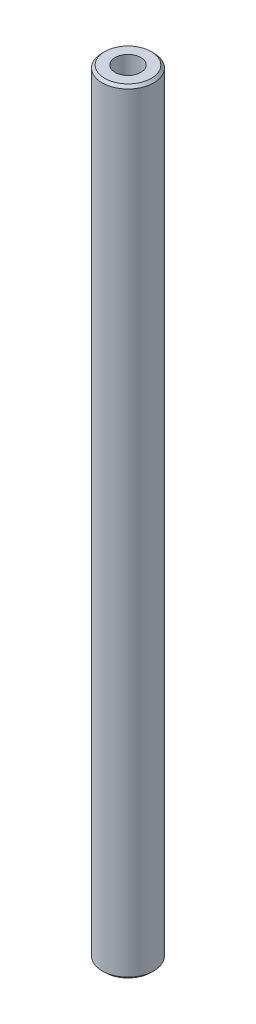
ISO-10303-21;
HEADER;
FILE_DESCRIPTION(('STEP AP214'),'2;1');
FILE_NAME('part.step','',(''),(''),'','','');
FILE_SCHEMA(('AUTOMOTIVE_DESIGN { 1 0 10303 214 1 1 1 1 }'));
ENDSEC;
DATA;
#1=APPLICATION_CONTEXT('core data for automotive mechanical design processes');
#2=APPLICATION_PROTOCOL_DEFINITION('international standard','automotive_design',2000,#1);
#3=PRODUCT_CONTEXT('',#1,'mechanical');
#4=PRODUCT('Part','Part','',(#3));
#5=PRODUCT_RELATED_PRODUCT_CATEGORY('part','',(#4));
#6=PRODUCT_DEFINITION_FORMATION('','',#4);
#7=PRODUCT_DEFINITION_CONTEXT('part definition',#1,'design');
#8=PRODUCT_DEFINITION('design','',#6,#7);
#9=PRODUCT_DEFINITION_SHAPE('','',#8);
#10=(LENGTH_UNIT() NAMED_UNIT(*) SI_UNIT(.MILLI.,.METRE.));
#11=(NAMED_UNIT(*) PLANE_ANGLE_UNIT() SI_UNIT($,.RADIAN.));
#12=(NAMED_UNIT(*) SI_UNIT($,.STERADIAN.) SOLID_ANGLE_UNIT());
#13=UNCERTAINTY_MEASURE_WITH_UNIT(LENGTH_MEASURE(1.E-05),#10,'distance_accuracy_value','');
#14=(GEOMETRIC_REPRESENTATION_CONTEXT(3) GLOBAL_UNCERTAINTY_ASSIGNED_CONTEXT((#13)) GLOBAL_UNIT_ASSIGNED_CONTEXT((#10,
#11,#12)) REPRESENTATION_CONTEXT('',''));
#15=CARTESIAN_POINT('',(0.,0.,0.));
#16=DIRECTION('',(0.,0.,1.));
#17=DIRECTION('',(1.,0.,0.));
#18=AXIS2_PLACEMENT_3D('',#15,#16,#17);
#19=CARTESIAN_POINT('',(0.,150.,0.));
#20=DIRECTION('',(0.,-1.,0.));
#21=DIRECTION('',(0.,0.,-1.));
#22=AXIS2_PLACEMENT_3D('',#19,#20,#21);
#23=CYLINDRICAL_SURFACE('',#22,5.);
#24=CARTESIAN_POINT('',(0.,149.5,0.));
#25=DIRECTION('',(0.,1.,0.));
#26=DIRECTION('',(0.,0.,1.));
#27=AXIS2_PLACEMENT_3D('',#24,#25,#26);
#28=CIRCLE('',#27,5.);
#29=CARTESIAN_POINT('',(0.,149.5,5.));
#30=VERTEX_POINT('',#29);
#31=EDGE_CURVE('E36',#30,#30,#28,.F.);
#32=ORIENTED_EDGE('',*,*,#31,.T.);
#33=EDGE_LOOP('',(#32));
#34=FACE_BOUND('',#33,.T.);
#35=CARTESIAN_POINT('',(0.,0.500000000000028,0.));
#36=DIRECTION('',(0.,1.,0.));
#37=DIRECTION('',(0.,0.,1.));
#38=AXIS2_PLACEMENT_3D('',#35,#36,#37);
#39=CIRCLE('',#38,5.);
#40=CARTESIAN_POINT('',(0.,0.500000000000028,5.));
#41=VERTEX_POINT('',#40);
#42=EDGE_CURVE('E40',#41,#41,#39,.T.);
#43=ORIENTED_EDGE('',*,*,#42,.T.);
#44=EDGE_LOOP('',(#43));
#45=FACE_BOUND('',#44,.T.);
#46=ADVANCED_FACE('F29',(#34,#45),#23,.T.);
#47=CARTESIAN_POINT('',(0.,150.,0.));
#48=DIRECTION('',(0.,1.,0.));
#49=DIRECTION('',(0.,0.,1.));
#50=AXIS2_PLACEMENT_3D('',#47,#48,#49);
#51=PLANE('',#50);
#52=CARTESIAN_POINT('',(0.,150.,0.));
#53=DIRECTION('',(0.,1.,0.));
#54=DIRECTION('',(0.,0.,1.));
#55=AXIS2_PLACEMENT_3D('',#52,#53,#54);
#56=CIRCLE('',#55,2.5);
#57=CARTESIAN_POINT('',(0.,150.,2.5));
#58=VERTEX_POINT('',#57);
#59=EDGE_CURVE('E56',#58,#58,#56,.T.);
#60=ORIENTED_EDGE('',*,*,#59,.F.);
#61=EDGE_LOOP('',(#60));
#62=FACE_BOUND('',#61,.T.);
#63=CARTESIAN_POINT('',(0.,150.,0.));
#64=DIRECTION('',(0.,1.,0.));
#65=DIRECTION('',(0.,0.,1.));
#66=AXIS2_PLACEMENT_3D('',#63,#64,#65);
#67=CIRCLE('',#66,4.50000000000002);
#68=CARTESIAN_POINT('',(0.,150.,4.50000000000002));
#69=VERTEX_POINT('',#68);
#70=EDGE_CURVE('E44',#69,#69,#67,.T.);
#71=ORIENTED_EDGE('',*,*,#70,.T.);
#72=EDGE_LOOP('',(#71));
#73=FACE_BOUND('',#72,.T.);
#74=ADVANCED_FACE('F71',(#62,#73),#51,.T.);
#75=CARTESIAN_POINT('',(0.,0.,0.));
#76=DIRECTION('',(0.,1.,0.));
#77=DIRECTION('',(0.,0.,1.));
#78=AXIS2_PLACEMENT_3D('',#75,#76,#77);
#79=PLANE('',#78);
#80=CARTESIAN_POINT('',(0.,0.,0.));
#81=DIRECTION('',(0.,-1.,0.));
#82=DIRECTION('',(0.,0.,-1.));
#83=AXIS2_PLACEMENT_3D('',#80,#81,#82);
#84=CIRCLE('',#83,2.5);
#85=CARTESIAN_POINT('',(0.,0.,-2.5));
#86=VERTEX_POINT('',#85);
#87=EDGE_CURVE('E50',#86,#86,#84,.T.);
#88=ORIENTED_EDGE('',*,*,#87,.F.);
#89=EDGE_LOOP('',(#88));
#90=FACE_BOUND('',#89,.T.);
#91=CARTESIAN_POINT('',(0.,0.,0.));
#92=DIRECTION('',(0.,1.,0.));
#93=DIRECTION('',(0.,0.,1.));
#94=AXIS2_PLACEMENT_3D('',#91,#92,#93);
#95=CIRCLE('',#94,4.49999999999998);
#96=CARTESIAN_POINT('',(0.,0.,4.49999999999998));
#97=VERTEX_POINT('',#96);
#98=EDGE_CURVE('E10',#97,#97,#95,.F.);
#99=ORIENTED_EDGE('',*,*,#98,.T.);
#100=EDGE_LOOP('',(#99));
#101=FACE_BOUND('',#100,.T.);
#102=ADVANCED_FACE('F74',(#90,#101),#79,.F.);
#103=CARTESIAN_POINT('',(0.,150.,0.));
#104=DIRECTION('',(0.,-1.,0.));
#105=DIRECTION('',(0.,0.,-1.));
#106=AXIS2_PLACEMENT_3D('',#103,#104,#105);
#107=CONICAL_SURFACE('',#106,4.50000000000002,0.785398163397458);
#108=ORIENTED_EDGE('',*,*,#31,.F.);
#109=EDGE_LOOP('',(#108));
#110=FACE_BOUND('',#109,.T.);
#111=ORIENTED_EDGE('',*,*,#70,.F.);
#112=EDGE_LOOP('',(#111));
#113=FACE_BOUND('',#112,.T.);
#114=ADVANCED_FACE('F78',(#110,#113),#107,.T.);
#115=CARTESIAN_POINT('',(0.,0.500000000000028,0.));
#116=DIRECTION('',(0.,1.,0.));
#117=DIRECTION('',(0.,0.,1.));
#118=AXIS2_PLACEMENT_3D('',#115,#116,#117);
#119=CONICAL_SURFACE('',#118,5.,0.785398163397444);
#120=ORIENTED_EDGE('',*,*,#98,.F.);
#121=EDGE_LOOP('',(#120));
#122=FACE_BOUND('',#121,.T.);
#123=ORIENTED_EDGE('',*,*,#42,.F.);
#124=EDGE_LOOP('',(#123));
#125=FACE_BOUND('',#124,.T.);
#126=ADVANCED_FACE('F31',(#122,#125),#119,.T.);
#127=CARTESIAN_POINT('',(0.,15.,0.));
#128=DIRECTION('',(0.,-1.,0.));
#129=DIRECTION('',(0.,0.,-1.));
#130=AXIS2_PLACEMENT_3D('',#127,#128,#129);
#131=CYLINDRICAL_SURFACE('',#130,2.5);
#132=CARTESIAN_POINT('',(0.,15.,0.));
#133=DIRECTION('',(0.,-1.,0.));
#134=DIRECTION('',(0.,0.,-1.));
#135=AXIS2_PLACEMENT_3D('',#132,#133,#134);
#136=CIRCLE('',#135,2.5);
#137=CARTESIAN_POINT('',(0.,15.,-2.5));
#138=VERTEX_POINT('',#137);
#139=EDGE_CURVE('E49',#138,#138,#136,.T.);
#140=ORIENTED_EDGE('',*,*,#139,.F.);
#141=EDGE_LOOP('',(#140));
#142=FACE_BOUND('',#141,.T.);
#143=ORIENTED_EDGE('',*,*,#87,.T.);
#144=EDGE_LOOP('',(#143));
#145=FACE_BOUND('',#144,.T.);
#146=ADVANCED_FACE('F85',(#142,#145),#131,.F.);
#147=CARTESIAN_POINT('',(0.,15.,0.));
#148=DIRECTION('',(0.,-1.,0.));
#149=DIRECTION('',(0.,0.,-1.));
#150=AXIS2_PLACEMENT_3D('',#147,#148,#149);
#151=PLANE('',#150);
#152=ORIENTED_EDGE('',*,*,#139,.T.);
#153=EDGE_LOOP('',(#152));
#154=FACE_BOUND('',#153,.T.);
#155=ADVANCED_FACE('F67',(#154),#151,.T.);
#156=CARTESIAN_POINT('',(0.,135.,0.));
#157=DIRECTION('',(0.,1.,0.));
#158=DIRECTION('',(0.,0.,1.));
#159=AXIS2_PLACEMENT_3D('',#156,#157,#158);
#160=CYLINDRICAL_SURFACE('',#159,2.5);
#161=CARTESIAN_POINT('',(0.,135.,0.));
#162=DIRECTION('',(0.,1.,0.));
#163=DIRECTION('',(0.,0.,1.));
#164=AXIS2_PLACEMENT_3D('',#161,#162,#163);
#165=CIRCLE('',#164,2.5);
#166=CARTESIAN_POINT('',(0.,135.,2.5));
#167=VERTEX_POINT('',#166);
#168=EDGE_CURVE('E53',#167,#167,#165,.T.);
#169=ORIENTED_EDGE('',*,*,#168,.F.);
#170=EDGE_LOOP('',(#169));
#171=FACE_BOUND('',#170,.T.);
#172=ORIENTED_EDGE('',*,*,#59,.T.);
#173=EDGE_LOOP('',(#172));
#174=FACE_BOUND('',#173,.T.);
#175=ADVANCED_FACE('F64',(#171,#174),#160,.F.);
#176=CARTESIAN_POINT('',(0.,135.,0.));
#177=DIRECTION('',(0.,1.,0.));
#178=DIRECTION('',(0.,0.,1.));
#179=AXIS2_PLACEMENT_3D('',#176,#177,#178);
#180=PLANE('',#179);
#181=ORIENTED_EDGE('',*,*,#168,.T.);
#182=EDGE_LOOP('',(#181));
#183=FACE_BOUND('',#182,.T.);
#184=ADVANCED_FACE('F62',(#183),#180,.T.);
#185=CLOSED_SHELL('',(#46,#74,#102,#114,#126,#146,#155,#175,#184));
#186=MANIFOLD_SOLID_BREP('B2',#185);
#187=ADVANCED_BREP_SHAPE_REPRESENTATION('',(#18,#186),#14);
#188=SHAPE_DEFINITION_REPRESENTATION(#9,#187);
ENDSEC;
END-ISO-10303-21;
